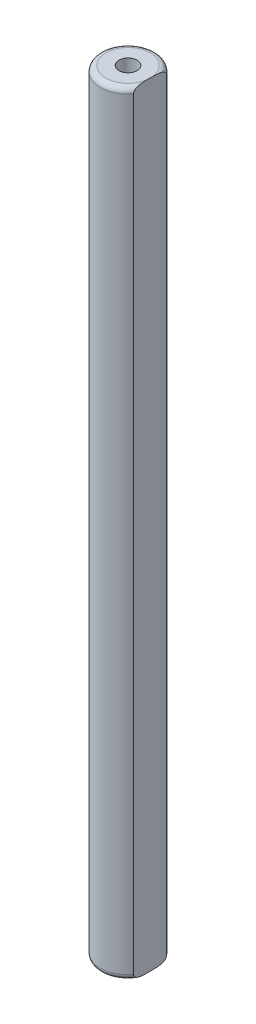
ISO-10303-21;
HEADER;
FILE_DESCRIPTION(('STEP AP214'),'2;1');
FILE_NAME('part.step','',(''),(''),'','','');
FILE_SCHEMA(('AUTOMOTIVE_DESIGN { 1 0 10303 214 1 1 1 1 }'));
ENDSEC;
DATA;
#1=APPLICATION_CONTEXT('core data for automotive mechanical design processes');
#2=APPLICATION_PROTOCOL_DEFINITION('international standard','automotive_design',2000,#1);
#3=PRODUCT_CONTEXT('',#1,'mechanical');
#4=PRODUCT('Part','Part','',(#3));
#5=PRODUCT_RELATED_PRODUCT_CATEGORY('part','',(#4));
#6=PRODUCT_DEFINITION_FORMATION('','',#4);
#7=PRODUCT_DEFINITION_CONTEXT('part definition',#1,'design');
#8=PRODUCT_DEFINITION('design','',#6,#7);
#9=PRODUCT_DEFINITION_SHAPE('','',#8);
#10=(LENGTH_UNIT() NAMED_UNIT(*) SI_UNIT(.MILLI.,.METRE.));
#11=(NAMED_UNIT(*) PLANE_ANGLE_UNIT() SI_UNIT($,.RADIAN.));
#12=(NAMED_UNIT(*) SI_UNIT($,.STERADIAN.) SOLID_ANGLE_UNIT());
#13=UNCERTAINTY_MEASURE_WITH_UNIT(LENGTH_MEASURE(1.E-05),#10,'distance_accuracy_value','');
#14=(GEOMETRIC_REPRESENTATION_CONTEXT(3) GLOBAL_UNCERTAINTY_ASSIGNED_CONTEXT((#13)) GLOBAL_UNIT_ASSIGNED_CONTEXT((#10,
#11,#12)) REPRESENTATION_CONTEXT('',''));
#15=CARTESIAN_POINT('',(0.,0.,0.));
#16=DIRECTION('',(0.,0.,1.));
#17=DIRECTION('',(1.,0.,0.));
#18=AXIS2_PLACEMENT_3D('',#15,#16,#17);
#19=CARTESIAN_POINT('',(0.,-35.15,0.));
#20=DIRECTION('',(0.,-1.,0.));
#21=DIRECTION('',(0.,0.,1.));
#22=AXIS2_PLACEMENT_3D('',#19,#20,#21);
#23=PLANE('',#22);
#24=CARTESIAN_POINT('',(0.,-35.15,0.));
#25=DIRECTION('',(0.,-1.,0.));
#26=DIRECTION('',(0.,0.,-1.));
#27=AXIS2_PLACEMENT_3D('',#24,#25,#26);
#28=CIRCLE('',#27,2.);
#29=CARTESIAN_POINT('',(2.,-35.15,0.));
#30=VERTEX_POINT('',#29);
#31=EDGE_CURVE('E11',#30,#30,#28,.T.);
#32=ORIENTED_EDGE('',*,*,#31,.T.);
#33=EDGE_LOOP('',(#32));
#34=FACE_BOUND('',#33,.T.);
#35=CARTESIAN_POINT('',(0.,-35.15,0.));
#36=DIRECTION('',(0.,1.,0.));
#37=DIRECTION('',(0.,0.,1.));
#38=AXIS2_PLACEMENT_3D('',#35,#36,#37);
#39=CIRCLE('',#38,0.825);
#40=CARTESIAN_POINT('',(0.,-35.15,0.825));
#41=VERTEX_POINT('',#40);
#42=EDGE_CURVE('E138',#41,#41,#39,.T.);
#43=ORIENTED_EDGE('',*,*,#42,.T.);
#44=EDGE_LOOP('',(#43));
#45=FACE_BOUND('',#44,.T.);
#46=ADVANCED_FACE('F34',(#34,#45),#23,.T.);
#47=CARTESIAN_POINT('',(0.,35.15,0.));
#48=DIRECTION('',(0.,-1.,0.));
#49=DIRECTION('',(0.,0.,-1.));
#50=AXIS2_PLACEMENT_3D('',#47,#48,#49);
#51=CYLINDRICAL_SURFACE('',#50,2.5);
#52=DIRECTION('',(0.,1.,0.));
#53=VECTOR('',#52,1.);
#54=CARTESIAN_POINT('',(2.,0.,-1.5));
#55=LINE('',#54,#53);
#56=CARTESIAN_POINT('',(2.,-34.65,-1.5));
#57=VERTEX_POINT('',#56);
#58=CARTESIAN_POINT('',(2.,34.65,-1.5));
#59=VERTEX_POINT('',#58);
#60=EDGE_CURVE('E81',#57,#59,#55,.T.);
#61=ORIENTED_EDGE('',*,*,#60,.F.);
#62=CARTESIAN_POINT('',(0.,-34.65,0.));
#63=DIRECTION('',(0.,-1.,0.));
#64=DIRECTION('',(0.,0.,-1.));
#65=AXIS2_PLACEMENT_3D('',#62,#63,#64);
#66=CIRCLE('',#65,2.5);
#67=CARTESIAN_POINT('',(2.,-34.65,1.5));
#68=VERTEX_POINT('',#67);
#69=EDGE_CURVE('E120',#57,#68,#66,.F.);
#70=ORIENTED_EDGE('',*,*,#69,.T.);
#71=DIRECTION('',(0.,1.,0.));
#72=VECTOR('',#71,1.);
#73=CARTESIAN_POINT('',(2.,0.,1.5));
#74=LINE('',#73,#72);
#75=CARTESIAN_POINT('',(2.,34.65,1.5));
#76=VERTEX_POINT('',#75);
#77=EDGE_CURVE('E126',#68,#76,#74,.T.);
#78=ORIENTED_EDGE('',*,*,#77,.T.);
#79=CARTESIAN_POINT('',(0.,34.65,0.));
#80=DIRECTION('',(0.,1.,0.));
#81=DIRECTION('',(0.,0.,1.));
#82=AXIS2_PLACEMENT_3D('',#79,#80,#81);
#83=CIRCLE('',#82,2.5);
#84=EDGE_CURVE('E76',#76,#59,#83,.F.);
#85=ORIENTED_EDGE('',*,*,#84,.T.);
#86=EDGE_LOOP('',(#61,#70,#78,#85));
#87=FACE_BOUND('',#86,.T.);
#88=ADVANCED_FACE('F157',(#87),#51,.T.);
#89=CARTESIAN_POINT('',(0.,35.15,0.));
#90=DIRECTION('',(0.,1.,0.));
#91=DIRECTION('',(0.,0.,1.));
#92=AXIS2_PLACEMENT_3D('',#89,#90,#91);
#93=PLANE('',#92);
#94=CARTESIAN_POINT('',(0.,35.15,0.));
#95=DIRECTION('',(0.,1.,0.));
#96=DIRECTION('',(0.,0.,1.));
#97=AXIS2_PLACEMENT_3D('',#94,#95,#96);
#98=CIRCLE('',#97,2.);
#99=CARTESIAN_POINT('',(2.,35.15,0.));
#100=VERTEX_POINT('',#99);
#101=EDGE_CURVE('E74',#100,#100,#98,.T.);
#102=ORIENTED_EDGE('',*,*,#101,.T.);
#103=EDGE_LOOP('',(#102));
#104=FACE_BOUND('',#103,.T.);
#105=CARTESIAN_POINT('',(0.,35.15,0.));
#106=DIRECTION('',(0.,1.,0.));
#107=DIRECTION('',(0.,0.,1.));
#108=AXIS2_PLACEMENT_3D('',#105,#106,#107);
#109=CIRCLE('',#108,0.825);
#110=CARTESIAN_POINT('',(0.,35.15,0.825));
#111=VERTEX_POINT('',#110);
#112=EDGE_CURVE('E89',#111,#111,#109,.T.);
#113=ORIENTED_EDGE('',*,*,#112,.F.);
#114=EDGE_LOOP('',(#113));
#115=FACE_BOUND('',#114,.T.);
#116=ADVANCED_FACE('F84',(#104,#115),#93,.T.);
#117=CARTESIAN_POINT('',(0.,30.15,0.));
#118=DIRECTION('',(0.,1.,0.));
#119=DIRECTION('',(0.,0.,1.));
#120=AXIS2_PLACEMENT_3D('',#117,#118,#119);
#121=CYLINDRICAL_SURFACE('',#120,0.825);
#122=CARTESIAN_POINT('',(0.,30.15,0.));
#123=DIRECTION('',(0.,1.,0.));
#124=DIRECTION('',(0.,0.,1.));
#125=AXIS2_PLACEMENT_3D('',#122,#123,#124);
#126=CIRCLE('',#125,0.825);
#127=CARTESIAN_POINT('',(0.,30.15,0.825));
#128=VERTEX_POINT('',#127);
#129=EDGE_CURVE('E86',#128,#128,#126,.T.);
#130=ORIENTED_EDGE('',*,*,#129,.F.);
#131=EDGE_LOOP('',(#130));
#132=FACE_BOUND('',#131,.T.);
#133=ORIENTED_EDGE('',*,*,#112,.T.);
#134=EDGE_LOOP('',(#133));
#135=FACE_BOUND('',#134,.T.);
#136=ADVANCED_FACE('F164',(#132,#135),#121,.F.);
#137=CARTESIAN_POINT('',(0.,30.15,0.));
#138=DIRECTION('',(0.,1.,0.));
#139=DIRECTION('',(0.,0.,1.));
#140=AXIS2_PLACEMENT_3D('',#137,#138,#139);
#141=PLANE('',#140);
#142=ORIENTED_EDGE('',*,*,#129,.T.);
#143=EDGE_LOOP('',(#142));
#144=FACE_BOUND('',#143,.T.);
#145=ADVANCED_FACE('F108',(#144),#141,.T.);
#146=CARTESIAN_POINT('',(2.,0.,-1.5));
#147=DIRECTION('',(-1.,0.,0.));
#148=DIRECTION('',(0.,0.,1.));
#149=AXIS2_PLACEMENT_3D('',#146,#147,#148);
#150=PLANE('',#149);
#151=ORIENTED_EDGE('',*,*,#77,.F.);
#152=CARTESIAN_POINT('',(2.,-34.65,1.5));
#153=CARTESIAN_POINT('',(2.,-34.6700065150284,1.50005508764519));
#154=CARTESIAN_POINT('',(2.,-34.6899505223803,1.49800297503596));
#155=CARTESIAN_POINT('',(2.,-34.7288908622129,1.49017103135305));
#156=CARTESIAN_POINT('',(2.,-34.747894786355,1.48442943896433));
#157=CARTESIAN_POINT('',(2.,-34.7845007170815,1.46971395516311));
#158=CARTESIAN_POINT('',(2.,-34.8021074472319,1.46075157527048));
#159=CARTESIAN_POINT('',(2.,-34.8357418270519,1.44018960181346));
#160=CARTESIAN_POINT('',(2.,-34.8517650844176,1.42858295243752));
#161=CARTESIAN_POINT('',(2.,-34.8889337995344,1.39760924057378));
#162=CARTESIAN_POINT('',(2.,-34.9091275913188,1.37710380043444));
#163=CARTESIAN_POINT('',(2.,-34.9460193785026,1.3332153788633));
#164=CARTESIAN_POINT('',(2.,-34.9627135559447,1.30982929844171));
#165=CARTESIAN_POINT('',(2.,-35.0025266059827,1.24588475655888));
#166=CARTESIAN_POINT('',(2.,-35.0231102761167,1.20375339504331));
#167=CARTESIAN_POINT('',(2.,-35.0492657628372,1.13857481760512));
#168=CARTESIAN_POINT('',(2.,-35.0572271665565,1.11639476146754));
#169=CARTESIAN_POINT('',(2.,-35.0717347834849,1.07158652733004));
#170=CARTESIAN_POINT('',(2.,-35.0782820228324,1.04895868735181));
#171=CARTESIAN_POINT('',(2.,-35.0954775535542,0.982989447767375));
#172=CARTESIAN_POINT('',(2.,-35.1045494991958,0.939240813702868));
#173=CARTESIAN_POINT('',(2.,-35.1194389319571,0.85118057519475));
#174=CARTESIAN_POINT('',(2.,-35.1252529100803,0.806868416119317));
#175=CARTESIAN_POINT('',(2.,-35.1345404183726,0.717748873858497));
#176=CARTESIAN_POINT('',(2.,-35.1380000262617,0.672940110398228));
#177=CARTESIAN_POINT('',(2.,-35.143276064899,0.583224127429996));
#178=CARTESIAN_POINT('',(2.,-35.1450920982067,0.53831688673903));
#179=CARTESIAN_POINT('',(2.,-35.1475884411658,0.45202717013826));
#180=CARTESIAN_POINT('',(2.,-35.148347176557,0.410646661478023));
#181=CARTESIAN_POINT('',(2.,-35.1493649293624,0.327877214900453));
#182=CARTESIAN_POINT('',(2.,-35.1496239046375,0.286488276566584));
#183=CARTESIAN_POINT('',(2.,-35.1499262759538,0.204245986253958));
#184=CARTESIAN_POINT('',(2.,-35.1499724201265,0.163392638975686));
#185=CARTESIAN_POINT('',(2.,-35.1499994454164,0.0816928216893292));
#186=CARTESIAN_POINT('',(2.,-35.1499803376138,0.0408463516913637));
#187=CARTESIAN_POINT('',(2.,-35.15,0.));
#188=B_SPLINE_CURVE_WITH_KNOTS('',3,(#152,#153,#154,#155,#156,#157,#158,#159,#160,#161,#162,
#163,#164,#165,#166,#167,#168,#169,#170,#171,#172,#173,#174,#175,#176,#177,#178,#179,#180,#181,
#182,#183,#184,#185,#186,#187),.UNSPECIFIED.,.F.,.F.,(4,2,2,2,2,2,2,2,2,2,2,2,2,2,2,2,2,4),(0.,
0.0598154823382477,0.119020807803606,0.178016596524454,0.237171689151979,0.323022405322567,
0.408966299732605,0.548800102010772,0.619474466309537,0.690097374684527,0.823948961414437,
0.957944437366601,1.09272554990601,1.22753924580541,1.35169671337948,1.47586464927862,
1.59842472260636,1.72096398530663),.UNSPECIFIED.);
#189=EDGE_CURVE('E43',#68,#30,#188,.T.);
#190=ORIENTED_EDGE('',*,*,#189,.T.);
#191=CARTESIAN_POINT('',(2.,-35.15,0.));
#192=CARTESIAN_POINT('',(2.,-35.149980484284,-0.0407626231076289));
#193=CARTESIAN_POINT('',(2.,-35.1499994433899,-0.0815253750922564));
#194=CARTESIAN_POINT('',(2.,-35.1499726519699,-0.163057529759021));
#195=CARTESIAN_POINT('',(2.,-35.1499268907924,-0.203826932431489));
#196=CARTESIAN_POINT('',(2.,-35.1496272394696,-0.285823216792328));
#197=CARTESIAN_POINT('',(2.,-35.1493710177251,-0.327050094241002));
#198=CARTESIAN_POINT('',(2.,-35.1483653267444,-0.409495794992682));
#199=CARTESIAN_POINT('',(2.,-35.1476158970779,-0.450714618676486));
#200=CARTESIAN_POINT('',(2.,-35.1452076449429,-0.534687159846425));
#201=CARTESIAN_POINT('',(2.,-35.1435155371863,-0.577440036322863));
#202=CARTESIAN_POINT('',(2.,-35.1386762279352,-0.662861842446352));
#203=CARTESIAN_POINT('',(2.,-35.1355293281928,-0.705530787660099));
#204=CARTESIAN_POINT('',(2.,-35.1271629448661,-0.790467964812873));
#205=CARTESIAN_POINT('',(2.,-35.1219534285849,-0.832737137282493));
#206=CARTESIAN_POINT('',(2.,-35.1087065375739,-0.916821134882455));
#207=CARTESIAN_POINT('',(2.,-35.1006717348777,-0.958636337716518));
#208=CARTESIAN_POINT('',(2.,-35.0868499282799,-1.01633423815903));
#209=CARTESIAN_POINT('',(2.,-35.0826447414506,-1.0325980627166));
#210=CARTESIAN_POINT('',(2.,-35.0735803939948,-1.06494846149724));
#211=CARTESIAN_POINT('',(2.,-35.0687209867408,-1.08103496638818));
#212=CARTESIAN_POINT('',(2.,-35.0530766101654,-1.12889043811801));
#213=CARTESIAN_POINT('',(2.,-35.0412104355907,-1.16032087149606));
#214=CARTESIAN_POINT('',(2.,-35.0138471087185,-1.22193787642586));
#215=CARTESIAN_POINT('',(2.,-34.9983172442343,-1.25211017751241));
#216=CARTESIAN_POINT('',(2.,-34.9629711649222,-1.30987180248264));
#217=CARTESIAN_POINT('',(2.,-34.9431618343013,-1.33746517402654));
#218=CARTESIAN_POINT('',(2.,-34.9063229296638,-1.37963467843693));
#219=CARTESIAN_POINT('',(2.,-34.890685118637,-1.39542133682361));
#220=CARTESIAN_POINT('',(2.,-34.8572261082969,-1.4245077100884));
#221=CARTESIAN_POINT('',(2.,-34.8394069701865,-1.43780974319198));
#222=CARTESIAN_POINT('',(2.,-34.8045634610992,-1.45935751669131));
#223=CARTESIAN_POINT('',(2.,-34.787825568107,-1.46806350146973));
#224=CARTESIAN_POINT('',(2.,-34.7531430315798,-1.48256312102217));
#225=CARTESIAN_POINT('',(2.,-34.7352009877708,-1.48836281472543));
#226=CARTESIAN_POINT('',(2.,-34.7059337018007,-1.49497096281988));
#227=CARTESIAN_POINT('',(2.,-34.6948421897842,-1.49684839330713));
#228=CARTESIAN_POINT('',(2.,-34.6725033908703,-1.49936626406293));
#229=CARTESIAN_POINT('',(2.,-34.6612558958349,-1.5000048503837));
#230=CARTESIAN_POINT('',(2.,-34.65,-1.5));
#231=B_SPLINE_CURVE_WITH_KNOTS('',3,(#191,#192,#193,#194,#195,#196,#197,#198,#199,#200,#201,
#202,#203,#204,#205,#206,#207,#208,#209,#210,#211,#212,#213,#214,#215,#216,#217,#218,#219,#220,
#221,#222,#223,#224,#225,#226,#227,#228,#229,#230),.UNSPECIFIED.,.F.,.F.,(4,2,2,2,2,2,2,2,2,2,2,
2,2,2,2,2,2,2,2,4),(0.,0.122288098502134,0.244596325308749,0.368278121933788,0.491949996900832,
0.620293921253729,0.74861123651507,0.876315899810972,1.00390460532892,1.05428854590096,
1.10469153363842,1.20529649885782,1.30683621704435,1.40821379274341,1.47468160162245,
1.54108708094666,1.5974625296124,1.65371995469663,1.68740390926937,1.72113823358774),.UNSPECIFIED.);
#232=EDGE_CURVE('E53',#30,#57,#231,.T.);
#233=ORIENTED_EDGE('',*,*,#232,.T.);
#234=ORIENTED_EDGE('',*,*,#60,.T.);
#235=CARTESIAN_POINT('',(2.,34.65,-1.5));
#236=CARTESIAN_POINT('',(2.,34.6700065150284,-1.50005508764519));
#237=CARTESIAN_POINT('',(2.,34.6899505223803,-1.49800297503596));
#238=CARTESIAN_POINT('',(2.,34.7288908622129,-1.49017103135305));
#239=CARTESIAN_POINT('',(2.,34.747894786355,-1.48442943896433));
#240=CARTESIAN_POINT('',(2.,34.7845007170815,-1.46971395516311));
#241=CARTESIAN_POINT('',(2.,34.8021074472319,-1.46075157527048));
#242=CARTESIAN_POINT('',(2.,34.8357418270519,-1.44018960181346));
#243=CARTESIAN_POINT('',(2.,34.8517650844176,-1.42858295243752));
#244=CARTESIAN_POINT('',(2.,34.8889337995344,-1.39760924057378));
#245=CARTESIAN_POINT('',(2.,34.9091275913188,-1.37710380043444));
#246=CARTESIAN_POINT('',(2.,34.9460193785026,-1.3332153788633));
#247=CARTESIAN_POINT('',(2.,34.9627135559447,-1.30982929844171));
#248=CARTESIAN_POINT('',(2.,35.0025266059827,-1.24588475655888));
#249=CARTESIAN_POINT('',(2.,35.0231102761167,-1.20375339504331));
#250=CARTESIAN_POINT('',(2.,35.0492657628372,-1.13857481760512));
#251=CARTESIAN_POINT('',(2.,35.0572271665565,-1.11639476146754));
#252=CARTESIAN_POINT('',(2.,35.0717347834849,-1.07158652733004));
#253=CARTESIAN_POINT('',(2.,35.0782820228324,-1.04895868735181));
#254=CARTESIAN_POINT('',(2.,35.0954775535542,-0.982989447767375));
#255=CARTESIAN_POINT('',(2.,35.1045494991958,-0.939240813702868));
#256=CARTESIAN_POINT('',(2.,35.1194389319571,-0.85118057519475));
#257=CARTESIAN_POINT('',(2.,35.1252529100803,-0.806868416119317));
#258=CARTESIAN_POINT('',(2.,35.1345404183726,-0.717748873858497));
#259=CARTESIAN_POINT('',(2.,35.1380000262617,-0.672940110398228));
#260=CARTESIAN_POINT('',(2.,35.143276064899,-0.583224127429996));
#261=CARTESIAN_POINT('',(2.,35.1450920982067,-0.53831688673903));
#262=CARTESIAN_POINT('',(2.,35.1475884411658,-0.45202717013826));
#263=CARTESIAN_POINT('',(2.,35.148347176557,-0.410646661478023));
#264=CARTESIAN_POINT('',(2.,35.1493649293624,-0.327877214900453));
#265=CARTESIAN_POINT('',(2.,35.1496239046375,-0.286488276566584));
#266=CARTESIAN_POINT('',(2.,35.1499262759538,-0.204245986253958));
#267=CARTESIAN_POINT('',(2.,35.1499724201265,-0.163392638975686));
#268=CARTESIAN_POINT('',(2.,35.1499994454164,-0.0816928216893292));
#269=CARTESIAN_POINT('',(2.,35.1499803376138,-0.0408463516913637));
#270=CARTESIAN_POINT('',(2.,35.15,0.));
#271=B_SPLINE_CURVE_WITH_KNOTS('',3,(#235,#236,#237,#238,#239,#240,#241,#242,#243,#244,#245,
#246,#247,#248,#249,#250,#251,#252,#253,#254,#255,#256,#257,#258,#259,#260,#261,#262,#263,#264,
#265,#266,#267,#268,#269,#270),.UNSPECIFIED.,.F.,.F.,(4,2,2,2,2,2,2,2,2,2,2,2,2,2,2,2,2,4),(0.,
0.0598154823382477,0.119020807803606,0.178016596524454,0.237171689151979,0.323022405322567,
0.408966299732605,0.548800102010772,0.619474466309537,0.690097374684527,0.823948961414437,
0.957944437366601,1.09272554990601,1.22753924580541,1.35169671337948,1.47586464927862,
1.59842472260636,1.72096398530663),.UNSPECIFIED.);
#272=EDGE_CURVE('E78',#59,#100,#271,.T.);
#273=ORIENTED_EDGE('',*,*,#272,.T.);
#274=CARTESIAN_POINT('',(2.,35.15,0.));
#275=CARTESIAN_POINT('',(2.,35.149980484284,0.0407626231076289));
#276=CARTESIAN_POINT('',(2.,35.1499994433899,0.0815253750922564));
#277=CARTESIAN_POINT('',(2.,35.1499726519699,0.163057529759021));
#278=CARTESIAN_POINT('',(2.,35.1499268907924,0.203826932431489));
#279=CARTESIAN_POINT('',(2.,35.1496272394696,0.285823216792328));
#280=CARTESIAN_POINT('',(2.,35.1493710177251,0.327050094241002));
#281=CARTESIAN_POINT('',(2.,35.1483653267444,0.409495794992682));
#282=CARTESIAN_POINT('',(2.,35.1476158970779,0.450714618676486));
#283=CARTESIAN_POINT('',(2.,35.1452076449429,0.534687159846425));
#284=CARTESIAN_POINT('',(2.,35.1435155371863,0.577440036322863));
#285=CARTESIAN_POINT('',(2.,35.1386762279352,0.662861842446352));
#286=CARTESIAN_POINT('',(2.,35.1355293281928,0.705530787660099));
#287=CARTESIAN_POINT('',(2.,35.1271629448661,0.790467964812873));
#288=CARTESIAN_POINT('',(2.,35.1219534285849,0.832737137282493));
#289=CARTESIAN_POINT('',(2.,35.1087065375739,0.916821134882455));
#290=CARTESIAN_POINT('',(2.,35.1006717348777,0.958636337716518));
#291=CARTESIAN_POINT('',(2.,35.0868499282799,1.01633423815903));
#292=CARTESIAN_POINT('',(2.,35.0826447414506,1.0325980627166));
#293=CARTESIAN_POINT('',(2.,35.0735803939948,1.06494846149724));
#294=CARTESIAN_POINT('',(2.,35.0687209867408,1.08103496638818));
#295=CARTESIAN_POINT('',(2.,35.0530766101654,1.12889043811801));
#296=CARTESIAN_POINT('',(2.,35.0412104355907,1.16032087149606));
#297=CARTESIAN_POINT('',(2.,35.0138471087185,1.22193787642586));
#298=CARTESIAN_POINT('',(2.,34.9983172442343,1.25211017751241));
#299=CARTESIAN_POINT('',(2.,34.9629711649222,1.30987180248264));
#300=CARTESIAN_POINT('',(2.,34.9431618343013,1.33746517402654));
#301=CARTESIAN_POINT('',(2.,34.9063229296638,1.37963467843693));
#302=CARTESIAN_POINT('',(2.,34.890685118637,1.39542133682361));
#303=CARTESIAN_POINT('',(2.,34.8572261082969,1.4245077100884));
#304=CARTESIAN_POINT('',(2.,34.8394069701865,1.43780974319198));
#305=CARTESIAN_POINT('',(2.,34.8045634610992,1.45935751669131));
#306=CARTESIAN_POINT('',(2.,34.787825568107,1.46806350146973));
#307=CARTESIAN_POINT('',(2.,34.7531430315798,1.48256312102217));
#308=CARTESIAN_POINT('',(2.,34.7352009877708,1.48836281472543));
#309=CARTESIAN_POINT('',(2.,34.7059337018007,1.49497096281988));
#310=CARTESIAN_POINT('',(2.,34.6948421897842,1.49684839330713));
#311=CARTESIAN_POINT('',(2.,34.6725033908703,1.49936626406293));
#312=CARTESIAN_POINT('',(2.,34.6612558958349,1.5000048503837));
#313=CARTESIAN_POINT('',(2.,34.65,1.5));
#314=B_SPLINE_CURVE_WITH_KNOTS('',3,(#274,#275,#276,#277,#278,#279,#280,#281,#282,#283,#284,
#285,#286,#287,#288,#289,#290,#291,#292,#293,#294,#295,#296,#297,#298,#299,#300,#301,#302,#303,
#304,#305,#306,#307,#308,#309,#310,#311,#312,#313),.UNSPECIFIED.,.F.,.F.,(4,2,2,2,2,2,2,2,2,2,2,
2,2,2,2,2,2,2,2,4),(0.,0.122288098502134,0.244596325308749,0.368278121933788,0.491949996900832,
0.620293921253729,0.74861123651507,0.876315899810972,1.00390460532892,1.05428854590096,
1.10469153363842,1.20529649885782,1.30683621704435,1.40821379274341,1.47468160162245,
1.54108708094666,1.5974625296124,1.65371995469663,1.68740390926937,1.72113823358774),.UNSPECIFIED.);
#315=EDGE_CURVE('E69',#100,#76,#314,.T.);
#316=ORIENTED_EDGE('',*,*,#315,.T.);
#317=EDGE_LOOP('',(#151,#190,#233,#234,#273,#316));
#318=FACE_BOUND('',#317,.T.);
#319=ADVANCED_FACE('F80',(#318),#150,.F.);
#320=CARTESIAN_POINT('',(0.,34.65,0.));
#321=DIRECTION('',(0.,1.,0.));
#322=DIRECTION('',(0.,0.,1.));
#323=AXIS2_PLACEMENT_3D('',#320,#321,#322);
#324=TOROIDAL_SURFACE('',#323,2.,0.5);
#325=ORIENTED_EDGE('',*,*,#272,.F.);
#326=ORIENTED_EDGE('',*,*,#84,.F.);
#327=ORIENTED_EDGE('',*,*,#315,.F.);
#328=ORIENTED_EDGE('',*,*,#101,.F.);
#329=EDGE_LOOP('',(#325,#326,#327,#328));
#330=FACE_BOUND('',#329,.T.);
#331=ADVANCED_FACE('F72',(#330),#324,.T.);
#332=CARTESIAN_POINT('',(0.,-30.15,0.));
#333=DIRECTION('',(0.,-1.,0.));
#334=DIRECTION('',(0.,0.,-1.));
#335=AXIS2_PLACEMENT_3D('',#332,#333,#334);
#336=CYLINDRICAL_SURFACE('',#335,0.825);
#337=CARTESIAN_POINT('',(0.,-30.15,0.));
#338=DIRECTION('',(0.,1.,0.));
#339=DIRECTION('',(0.,0.,1.));
#340=AXIS2_PLACEMENT_3D('',#337,#338,#339);
#341=CIRCLE('',#340,0.825);
#342=CARTESIAN_POINT('',(0.,-30.15,0.825));
#343=VERTEX_POINT('',#342);
#344=EDGE_CURVE('E136',#343,#343,#341,.T.);
#345=ORIENTED_EDGE('',*,*,#344,.T.);
#346=EDGE_LOOP('',(#345));
#347=FACE_BOUND('',#346,.T.);
#348=ORIENTED_EDGE('',*,*,#42,.F.);
#349=EDGE_LOOP('',(#348));
#350=FACE_BOUND('',#349,.T.);
#351=ADVANCED_FACE('F147',(#347,#350),#336,.F.);
#352=CARTESIAN_POINT('',(0.,-30.15,0.));
#353=DIRECTION('',(0.,-1.,0.));
#354=DIRECTION('',(0.,0.,1.));
#355=AXIS2_PLACEMENT_3D('',#352,#353,#354);
#356=PLANE('',#355);
#357=ORIENTED_EDGE('',*,*,#344,.F.);
#358=EDGE_LOOP('',(#357));
#359=FACE_BOUND('',#358,.T.);
#360=ADVANCED_FACE('F149',(#359),#356,.T.);
#361=CARTESIAN_POINT('',(0.,-34.65,0.));
#362=DIRECTION('',(0.,-1.,0.));
#363=DIRECTION('',(0.,0.,-1.));
#364=AXIS2_PLACEMENT_3D('',#361,#362,#363);
#365=TOROIDAL_SURFACE('',#364,2.,0.5);
#366=ORIENTED_EDGE('',*,*,#232,.F.);
#367=ORIENTED_EDGE('',*,*,#31,.F.);
#368=ORIENTED_EDGE('',*,*,#189,.F.);
#369=ORIENTED_EDGE('',*,*,#69,.F.);
#370=EDGE_LOOP('',(#366,#367,#368,#369));
#371=FACE_BOUND('',#370,.T.);
#372=ADVANCED_FACE('F36',(#371),#365,.T.);
#373=CLOSED_SHELL('',(#46,#88,#116,#136,#145,#319,#331,#351,#360,#372));
#374=MANIFOLD_SOLID_BREP('B2',#373);
#375=ADVANCED_BREP_SHAPE_REPRESENTATION('',(#18,#374),#14);
#376=SHAPE_DEFINITION_REPRESENTATION(#9,#375);
ENDSEC;
END-ISO-10303-21;
